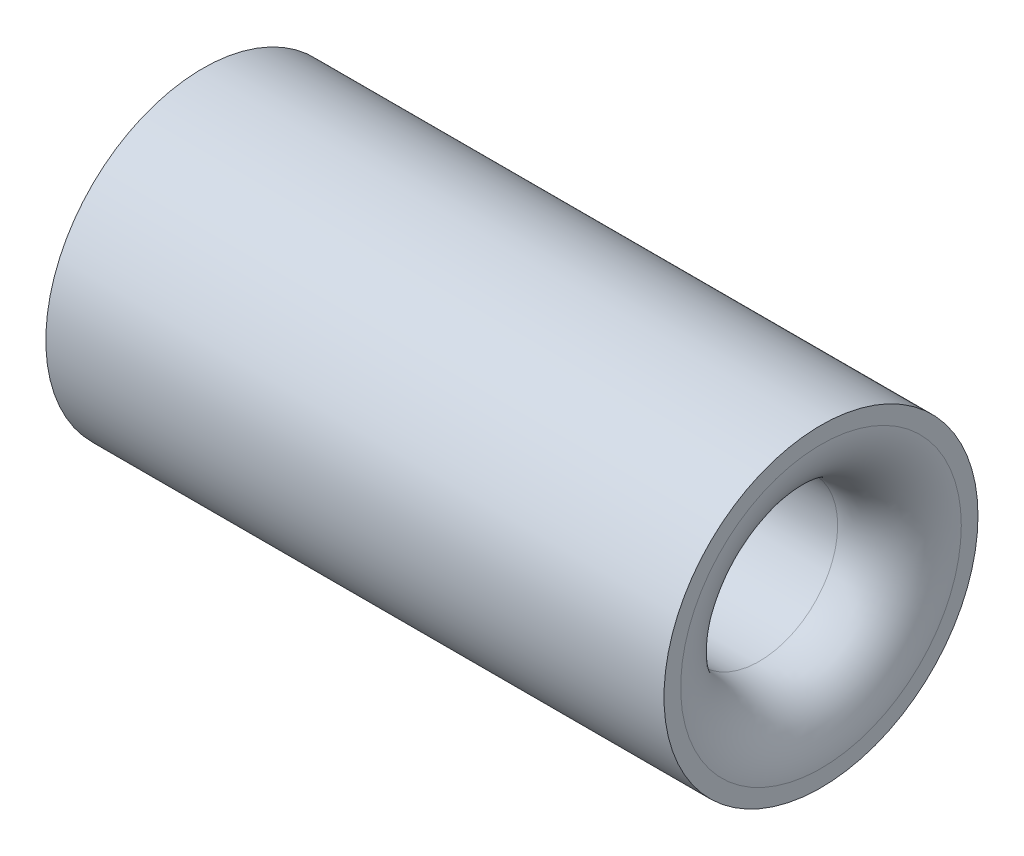
ISO-10303-21;
HEADER;
FILE_DESCRIPTION(('STEP AP214'),'2;1');
FILE_NAME('part.step','',(''),(''),'','','');
FILE_SCHEMA(('AUTOMOTIVE_DESIGN { 1 0 10303 214 1 1 1 1 }'));
ENDSEC;
DATA;
#1=APPLICATION_CONTEXT('core data for automotive mechanical design processes');
#2=APPLICATION_PROTOCOL_DEFINITION('international standard','automotive_design',2000,#1);
#3=PRODUCT_CONTEXT('',#1,'mechanical');
#4=PRODUCT('Part','Part','',(#3));
#5=PRODUCT_RELATED_PRODUCT_CATEGORY('part','',(#4));
#6=PRODUCT_DEFINITION_FORMATION('','',#4);
#7=PRODUCT_DEFINITION_CONTEXT('part definition',#1,'design');
#8=PRODUCT_DEFINITION('design','',#6,#7);
#9=PRODUCT_DEFINITION_SHAPE('','',#8);
#10=(LENGTH_UNIT() NAMED_UNIT(*) SI_UNIT(.MILLI.,.METRE.));
#11=(NAMED_UNIT(*) PLANE_ANGLE_UNIT() SI_UNIT($,.RADIAN.));
#12=(NAMED_UNIT(*) SI_UNIT($,.STERADIAN.) SOLID_ANGLE_UNIT());
#13=UNCERTAINTY_MEASURE_WITH_UNIT(LENGTH_MEASURE(1.E-05),#10,'distance_accuracy_value','');
#14=(GEOMETRIC_REPRESENTATION_CONTEXT(3) GLOBAL_UNCERTAINTY_ASSIGNED_CONTEXT((#13)) GLOBAL_UNIT_ASSIGNED_CONTEXT((#10,
#11,#12)) REPRESENTATION_CONTEXT('',''));
#15=CARTESIAN_POINT('',(0.,0.,0.));
#16=DIRECTION('',(0.,0.,1.));
#17=DIRECTION('',(1.,0.,0.));
#18=AXIS2_PLACEMENT_3D('',#15,#16,#17);
#19=CARTESIAN_POINT('',(50.,0.,0.));
#20=DIRECTION('',(-1.,0.,0.));
#21=DIRECTION('',(0.,0.,1.));
#22=AXIS2_PLACEMENT_3D('',#19,#20,#21);
#23=CYLINDRICAL_SURFACE('',#22,12.7);
#24=CARTESIAN_POINT('',(50.,0.,0.));
#25=DIRECTION('',(1.,0.,0.));
#26=DIRECTION('',(0.,0.,-1.));
#27=AXIS2_PLACEMENT_3D('',#24,#25,#26);
#28=CIRCLE('',#27,12.7);
#29=CARTESIAN_POINT('',(50.,0.,-12.7));
#30=VERTEX_POINT('',#29);
#31=EDGE_CURVE('E42',#30,#30,#28,.T.);
#32=ORIENTED_EDGE('',*,*,#31,.F.);
#33=EDGE_LOOP('',(#32));
#34=FACE_BOUND('',#33,.T.);
#35=CARTESIAN_POINT('',(0.,0.,0.));
#36=DIRECTION('',(1.,0.,0.));
#37=DIRECTION('',(0.,0.,-1.));
#38=AXIS2_PLACEMENT_3D('',#35,#36,#37);
#39=CIRCLE('',#38,12.7);
#40=CARTESIAN_POINT('',(0.,0.,-12.7));
#41=VERTEX_POINT('',#40);
#42=EDGE_CURVE('E46',#41,#41,#39,.T.);
#43=ORIENTED_EDGE('',*,*,#42,.T.);
#44=EDGE_LOOP('',(#43));
#45=FACE_BOUND('',#44,.T.);
#46=ADVANCED_FACE('F31',(#34,#45),#23,.T.);
#47=CARTESIAN_POINT('',(50.,0.,0.));
#48=DIRECTION('',(1.,0.,0.));
#49=DIRECTION('',(0.,0.,-1.));
#50=AXIS2_PLACEMENT_3D('',#47,#48,#49);
#51=PLANE('',#50);
#52=CARTESIAN_POINT('',(50.,0.,0.));
#53=DIRECTION('',(1.,0.,0.));
#54=DIRECTION('',(0.,0.,-1.));
#55=AXIS2_PLACEMENT_3D('',#52,#53,#54);
#56=CIRCLE('',#55,11.35);
#57=CARTESIAN_POINT('',(50.,0.,-11.35));
#58=VERTEX_POINT('',#57);
#59=EDGE_CURVE('E10',#58,#58,#56,.F.);
#60=ORIENTED_EDGE('',*,*,#59,.T.);
#61=EDGE_LOOP('',(#60));
#62=FACE_BOUND('',#61,.T.);
#63=ORIENTED_EDGE('',*,*,#31,.T.);
#64=EDGE_LOOP('',(#63));
#65=FACE_BOUND('',#64,.T.);
#66=ADVANCED_FACE('F66',(#62,#65),#51,.T.);
#67=CARTESIAN_POINT('',(0.,0.,0.));
#68=DIRECTION('',(1.,0.,0.));
#69=DIRECTION('',(0.,0.,-1.));
#70=AXIS2_PLACEMENT_3D('',#67,#68,#69);
#71=PLANE('',#70);
#72=CARTESIAN_POINT('',(0.,0.,0.));
#73=DIRECTION('',(1.,0.,0.));
#74=DIRECTION('',(0.,0.,-1.));
#75=AXIS2_PLACEMENT_3D('',#72,#73,#74);
#76=CIRCLE('',#75,6.35);
#77=CARTESIAN_POINT('',(0.,0.,-6.35));
#78=VERTEX_POINT('',#77);
#79=EDGE_CURVE('E50',#78,#78,#76,.T.);
#80=ORIENTED_EDGE('',*,*,#79,.T.);
#81=EDGE_LOOP('',(#80));
#82=FACE_BOUND('',#81,.T.);
#83=ORIENTED_EDGE('',*,*,#42,.F.);
#84=EDGE_LOOP('',(#83));
#85=FACE_BOUND('',#84,.T.);
#86=ADVANCED_FACE('F55',(#82,#85),#71,.F.);
#87=CARTESIAN_POINT('',(0.,0.,0.));
#88=DIRECTION('',(1.,0.,0.));
#89=DIRECTION('',(0.,0.,-1.));
#90=AXIS2_PLACEMENT_3D('',#87,#88,#89);
#91=CYLINDRICAL_SURFACE('',#90,6.35);
#92=CARTESIAN_POINT('',(45.,0.,0.));
#93=DIRECTION('',(1.,0.,0.));
#94=DIRECTION('',(0.,0.,-1.));
#95=AXIS2_PLACEMENT_3D('',#92,#93,#94);
#96=CIRCLE('',#95,6.35);
#97=CARTESIAN_POINT('',(45.,0.,-6.35));
#98=VERTEX_POINT('',#97);
#99=EDGE_CURVE('E38',#98,#98,#96,.T.);
#100=ORIENTED_EDGE('',*,*,#99,.T.);
#101=EDGE_LOOP('',(#100));
#102=FACE_BOUND('',#101,.T.);
#103=ORIENTED_EDGE('',*,*,#79,.F.);
#104=EDGE_LOOP('',(#103));
#105=FACE_BOUND('',#104,.T.);
#106=ADVANCED_FACE('F58',(#102,#105),#91,.F.);
#107=CARTESIAN_POINT('',(45.,0.,0.));
#108=DIRECTION('',(1.,0.,0.));
#109=DIRECTION('',(0.,0.,-1.));
#110=AXIS2_PLACEMENT_3D('',#107,#108,#109);
#111=TOROIDAL_SURFACE('',#110,11.35,5.);
#112=ORIENTED_EDGE('',*,*,#59,.F.);
#113=EDGE_LOOP('',(#112));
#114=FACE_BOUND('',#113,.T.);
#115=ORIENTED_EDGE('',*,*,#99,.F.);
#116=EDGE_LOOP('',(#115));
#117=FACE_BOUND('',#116,.T.);
#118=ADVANCED_FACE('F33',(#114,#117),#111,.T.);
#119=CLOSED_SHELL('',(#46,#66,#86,#106,#118));
#120=MANIFOLD_SOLID_BREP('B2',#119);
#121=ADVANCED_BREP_SHAPE_REPRESENTATION('',(#18,#120),#14);
#122=SHAPE_DEFINITION_REPRESENTATION(#9,#121);
ENDSEC;
END-ISO-10303-21;
